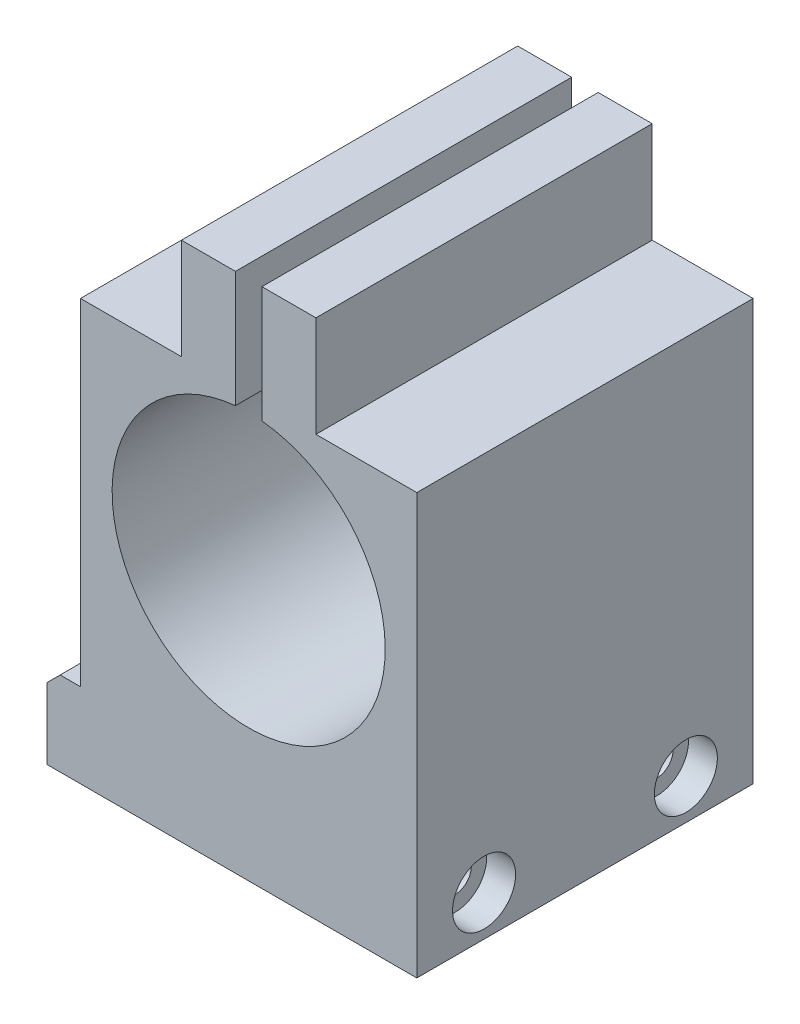
ISO-10303-21;
HEADER;
FILE_DESCRIPTION(('STEP AP214'),'2;1');
FILE_NAME('part.step','',(''),(''),'','','');
FILE_SCHEMA(('AUTOMOTIVE_DESIGN { 1 0 10303 214 1 1 1 1 }'));
ENDSEC;
DATA;
#1=APPLICATION_CONTEXT('core data for automotive mechanical design processes');
#2=APPLICATION_PROTOCOL_DEFINITION('international standard','automotive_design',2000,#1);
#3=PRODUCT_CONTEXT('',#1,'mechanical');
#4=PRODUCT('Part','Part','',(#3));
#5=PRODUCT_RELATED_PRODUCT_CATEGORY('part','',(#4));
#6=PRODUCT_DEFINITION_FORMATION('','',#4);
#7=PRODUCT_DEFINITION_CONTEXT('part definition',#1,'design');
#8=PRODUCT_DEFINITION('design','',#6,#7);
#9=PRODUCT_DEFINITION_SHAPE('','',#8);
#10=(LENGTH_UNIT() NAMED_UNIT(*) SI_UNIT(.MILLI.,.METRE.));
#11=(NAMED_UNIT(*) PLANE_ANGLE_UNIT() SI_UNIT($,.RADIAN.));
#12=(NAMED_UNIT(*) SI_UNIT($,.STERADIAN.) SOLID_ANGLE_UNIT());
#13=UNCERTAINTY_MEASURE_WITH_UNIT(LENGTH_MEASURE(1.E-05),#10,'distance_accuracy_value','');
#14=(GEOMETRIC_REPRESENTATION_CONTEXT(3) GLOBAL_UNCERTAINTY_ASSIGNED_CONTEXT((#13)) GLOBAL_UNIT_ASSIGNED_CONTEXT((#10,
#11,#12)) REPRESENTATION_CONTEXT('',''));
#15=CARTESIAN_POINT('',(0.,0.,0.));
#16=DIRECTION('',(0.,0.,1.));
#17=DIRECTION('',(1.,0.,0.));
#18=AXIS2_PLACEMENT_3D('',#15,#16,#17);
#19=CARTESIAN_POINT('',(15.3498255547082,26.67,25.4));
#20=DIRECTION('',(0.,0.,-1.));
#21=DIRECTION('',(-1.,0.,0.));
#22=AXIS2_PLACEMENT_3D('',#19,#20,#21);
#23=CYLINDRICAL_SURFACE('',#22,10.3124);
#24=CARTESIAN_POINT('',(15.3498255547082,26.67,0.));
#25=DIRECTION('',(0.,0.,1.));
#26=DIRECTION('',(1.,0.,0.));
#27=AXIS2_PLACEMENT_3D('',#24,#25,#26);
#28=CIRCLE('',#27,10.3124);
#29=CARTESIAN_POINT('',(14.3498255547082,36.9338001617335,0.));
#30=VERTEX_POINT('',#29);
#31=CARTESIAN_POINT('',(16.3498255547082,36.9338001617335,0.));
#32=VERTEX_POINT('',#31);
#33=EDGE_CURVE('E145',#30,#32,#28,.T.);
#34=ORIENTED_EDGE('',*,*,#33,.F.);
#35=DIRECTION('',(0.,0.,-1.));
#36=VECTOR('',#35,1.);
#37=CARTESIAN_POINT('',(14.3498255547082,36.9338001617335,25.4));
#38=LINE('',#37,#36);
#39=CARTESIAN_POINT('',(14.3498255547082,36.9338001617335,25.4));
#40=VERTEX_POINT('',#39);
#41=EDGE_CURVE('E140',#40,#30,#38,.T.);
#42=ORIENTED_EDGE('',*,*,#41,.F.);
#43=CARTESIAN_POINT('',(15.3498255547082,26.67,25.4));
#44=DIRECTION('',(0.,0.,1.));
#45=DIRECTION('',(1.,0.,0.));
#46=AXIS2_PLACEMENT_3D('',#43,#44,#45);
#47=CIRCLE('',#46,10.3124);
#48=CARTESIAN_POINT('',(16.3498255547082,36.9338001617335,25.4));
#49=VERTEX_POINT('',#48);
#50=EDGE_CURVE('E142',#40,#49,#47,.T.);
#51=ORIENTED_EDGE('',*,*,#50,.T.);
#52=DIRECTION('',(0.,0.,-1.));
#53=VECTOR('',#52,1.);
#54=CARTESIAN_POINT('',(16.3498255547082,36.9338001617335,25.4));
#55=LINE('',#54,#53);
#56=EDGE_CURVE('E194',#49,#32,#55,.T.);
#57=ORIENTED_EDGE('',*,*,#56,.T.);
#58=EDGE_LOOP('',(#34,#42,#51,#57));
#59=FACE_BOUND('',#58,.T.);
#60=ADVANCED_FACE('F35',(#59),#23,.F.);
#61=CARTESIAN_POINT('',(14.3498255547082,0.,25.4));
#62=DIRECTION('',(1.,0.,0.));
#63=DIRECTION('',(0.,0.,-1.));
#64=AXIS2_PLACEMENT_3D('',#61,#62,#63);
#65=PLANE('',#64);
#66=DIRECTION('',(0.,-1.,0.));
#67=VECTOR('',#66,1.);
#68=CARTESIAN_POINT('',(14.3498255547082,0.,0.));
#69=LINE('',#68,#67);
#70=CARTESIAN_POINT('',(14.3498255547082,45.72,0.));
#71=VERTEX_POINT('',#70);
#72=EDGE_CURVE('E196',#71,#30,#69,.T.);
#73=ORIENTED_EDGE('',*,*,#72,.F.);
#74=DIRECTION('',(0.,0.,-1.));
#75=VECTOR('',#74,1.);
#76=CARTESIAN_POINT('',(14.3498255547082,45.72,25.4));
#77=LINE('',#76,#75);
#78=CARTESIAN_POINT('',(14.3498255547082,45.72,25.4));
#79=VERTEX_POINT('',#78);
#80=EDGE_CURVE('E151',#79,#71,#77,.T.);
#81=ORIENTED_EDGE('',*,*,#80,.F.);
#82=DIRECTION('',(0.,-1.,0.));
#83=VECTOR('',#82,1.);
#84=CARTESIAN_POINT('',(14.3498255547082,0.,25.4));
#85=LINE('',#84,#83);
#86=EDGE_CURVE('E156',#79,#40,#85,.T.);
#87=ORIENTED_EDGE('',*,*,#86,.T.);
#88=ORIENTED_EDGE('',*,*,#41,.T.);
#89=EDGE_LOOP('',(#73,#81,#87,#88));
#90=FACE_BOUND('',#89,.T.);
#91=ADVANCED_FACE('F161',(#90),#65,.T.);
#92=CARTESIAN_POINT('',(0.,45.72,25.4));
#93=DIRECTION('',(0.,-1.,0.));
#94=DIRECTION('',(0.,0.,-1.));
#95=AXIS2_PLACEMENT_3D('',#92,#93,#94);
#96=PLANE('',#95);
#97=DIRECTION('',(-1.,0.,0.));
#98=VECTOR('',#97,1.);
#99=CARTESIAN_POINT('',(0.,45.72,0.));
#100=LINE('',#99,#98);
#101=CARTESIAN_POINT('',(10.2698255547082,45.72,0.));
#102=VERTEX_POINT('',#101);
#103=EDGE_CURVE('E199',#71,#102,#100,.T.);
#104=ORIENTED_EDGE('',*,*,#103,.T.);
#105=DIRECTION('',(0.,0.,-1.));
#106=VECTOR('',#105,1.);
#107=CARTESIAN_POINT('',(10.2698255547082,45.72,25.4));
#108=LINE('',#107,#106);
#109=CARTESIAN_POINT('',(10.2698255547082,45.72,25.4));
#110=VERTEX_POINT('',#109);
#111=EDGE_CURVE('E252',#110,#102,#108,.T.);
#112=ORIENTED_EDGE('',*,*,#111,.F.);
#113=DIRECTION('',(-1.,0.,0.));
#114=VECTOR('',#113,1.);
#115=CARTESIAN_POINT('',(0.,45.72,25.4));
#116=LINE('',#115,#114);
#117=EDGE_CURVE('E163',#79,#110,#116,.T.);
#118=ORIENTED_EDGE('',*,*,#117,.F.);
#119=ORIENTED_EDGE('',*,*,#80,.T.);
#120=EDGE_LOOP('',(#104,#112,#118,#119));
#121=FACE_BOUND('',#120,.T.);
#122=ADVANCED_FACE('F291',(#121),#96,.F.);
#123=CARTESIAN_POINT('',(10.2698255547082,0.,25.4));
#124=DIRECTION('',(-1.,0.,0.));
#125=DIRECTION('',(0.,0.,1.));
#126=AXIS2_PLACEMENT_3D('',#123,#124,#125);
#127=PLANE('',#126);
#128=DIRECTION('',(0.,1.,0.));
#129=VECTOR('',#128,1.);
#130=CARTESIAN_POINT('',(10.2698255547082,0.,0.));
#131=LINE('',#130,#129);
#132=CARTESIAN_POINT('',(10.2698255547082,38.1,0.));
#133=VERTEX_POINT('',#132);
#134=EDGE_CURVE('E202',#133,#102,#131,.T.);
#135=ORIENTED_EDGE('',*,*,#134,.F.);
#136=DIRECTION('',(0.,0.,-1.));
#137=VECTOR('',#136,1.);
#138=CARTESIAN_POINT('',(10.2698255547082,38.1,25.4));
#139=LINE('',#138,#137);
#140=CARTESIAN_POINT('',(10.2698255547082,38.1,25.4));
#141=VERTEX_POINT('',#140);
#142=EDGE_CURVE('E250',#141,#133,#139,.T.);
#143=ORIENTED_EDGE('',*,*,#142,.F.);
#144=DIRECTION('',(0.,1.,0.));
#145=VECTOR('',#144,1.);
#146=CARTESIAN_POINT('',(10.2698255547082,0.,25.4));
#147=LINE('',#146,#145);
#148=EDGE_CURVE('E165',#141,#110,#147,.T.);
#149=ORIENTED_EDGE('',*,*,#148,.T.);
#150=ORIENTED_EDGE('',*,*,#111,.T.);
#151=EDGE_LOOP('',(#135,#143,#149,#150));
#152=FACE_BOUND('',#151,.T.);
#153=ADVANCED_FACE('F296',(#152),#127,.T.);
#154=CARTESIAN_POINT('',(0.,38.1,25.4));
#155=DIRECTION('',(0.,1.,0.));
#156=DIRECTION('',(0.,0.,1.));
#157=AXIS2_PLACEMENT_3D('',#154,#155,#156);
#158=PLANE('',#157);
#159=DIRECTION('',(1.,0.,0.));
#160=VECTOR('',#159,1.);
#161=CARTESIAN_POINT('',(0.,38.1,0.));
#162=LINE('',#161,#160);
#163=CARTESIAN_POINT('',(2.64982555470824,38.1,0.));
#164=VERTEX_POINT('',#163);
#165=EDGE_CURVE('E205',#164,#133,#162,.T.);
#166=ORIENTED_EDGE('',*,*,#165,.F.);
#167=DIRECTION('',(0.,0.,-1.));
#168=VECTOR('',#167,1.);
#169=CARTESIAN_POINT('',(2.64982555470824,38.1,25.4));
#170=LINE('',#169,#168);
#171=CARTESIAN_POINT('',(2.64982555470824,38.1,25.4));
#172=VERTEX_POINT('',#171);
#173=EDGE_CURVE('E248',#172,#164,#170,.T.);
#174=ORIENTED_EDGE('',*,*,#173,.F.);
#175=DIRECTION('',(1.,0.,0.));
#176=VECTOR('',#175,1.);
#177=CARTESIAN_POINT('',(0.,38.1,25.4));
#178=LINE('',#177,#176);
#179=EDGE_CURVE('E171',#172,#141,#178,.T.);
#180=ORIENTED_EDGE('',*,*,#179,.T.);
#181=ORIENTED_EDGE('',*,*,#142,.T.);
#182=EDGE_LOOP('',(#166,#174,#180,#181));
#183=FACE_BOUND('',#182,.T.);
#184=ADVANCED_FACE('F300',(#183),#158,.T.);
#185=CARTESIAN_POINT('',(2.64982555470824,0.,25.4));
#186=DIRECTION('',(-1.,0.,0.));
#187=DIRECTION('',(0.,0.,1.));
#188=AXIS2_PLACEMENT_3D('',#185,#186,#187);
#189=PLANE('',#188);
#190=DIRECTION('',(0.,1.,0.));
#191=VECTOR('',#190,1.);
#192=CARTESIAN_POINT('',(2.64982555470824,0.,0.));
#193=LINE('',#192,#191);
#194=CARTESIAN_POINT('',(2.64982555470824,12.7,0.));
#195=VERTEX_POINT('',#194);
#196=EDGE_CURVE('E208',#195,#164,#193,.T.);
#197=ORIENTED_EDGE('',*,*,#196,.F.);
#198=DIRECTION('',(0.,0.,-1.));
#199=VECTOR('',#198,1.);
#200=CARTESIAN_POINT('',(2.64982555470824,12.7,25.4));
#201=LINE('',#200,#199);
#202=CARTESIAN_POINT('',(2.64982555470824,12.7,25.4));
#203=VERTEX_POINT('',#202);
#204=EDGE_CURVE('E245',#203,#195,#201,.T.);
#205=ORIENTED_EDGE('',*,*,#204,.F.);
#206=DIRECTION('',(0.,1.,0.));
#207=VECTOR('',#206,1.);
#208=CARTESIAN_POINT('',(2.64982555470824,0.,25.4));
#209=LINE('',#208,#207);
#210=EDGE_CURVE('E174',#203,#172,#209,.T.);
#211=ORIENTED_EDGE('',*,*,#210,.T.);
#212=ORIENTED_EDGE('',*,*,#173,.T.);
#213=EDGE_LOOP('',(#197,#205,#211,#212));
#214=FACE_BOUND('',#213,.T.);
#215=ADVANCED_FACE('F304',(#214),#189,.T.);
#216=CARTESIAN_POINT('',(0.,12.7,25.4));
#217=DIRECTION('',(0.,1.,0.));
#218=DIRECTION('',(0.,0.,1.));
#219=AXIS2_PLACEMENT_3D('',#216,#217,#218);
#220=PLANE('',#219);
#221=DIRECTION('',(1.,0.,0.));
#222=VECTOR('',#221,1.);
#223=CARTESIAN_POINT('',(0.,12.7,0.));
#224=LINE('',#223,#222);
#225=CARTESIAN_POINT('',(1.10982555470824,12.7,0.));
#226=VERTEX_POINT('',#225);
#227=EDGE_CURVE('E211',#226,#195,#224,.T.);
#228=ORIENTED_EDGE('',*,*,#227,.F.);
#229=DIRECTION('',(0.,0.,1.));
#230=VECTOR('',#229,1.);
#231=CARTESIAN_POINT('',(1.10982555470824,12.7,25.4));
#232=LINE('',#231,#230);
#233=CARTESIAN_POINT('',(1.10982555470824,12.7,25.4));
#234=VERTEX_POINT('',#233);
#235=EDGE_CURVE('E43',#226,#234,#232,.T.);
#236=ORIENTED_EDGE('',*,*,#235,.T.);
#237=DIRECTION('',(1.,0.,0.));
#238=VECTOR('',#237,1.);
#239=CARTESIAN_POINT('',(0.,12.7,25.4));
#240=LINE('',#239,#238);
#241=EDGE_CURVE('E177',#234,#203,#240,.T.);
#242=ORIENTED_EDGE('',*,*,#241,.T.);
#243=ORIENTED_EDGE('',*,*,#204,.T.);
#244=EDGE_LOOP('',(#228,#236,#242,#243));
#245=FACE_BOUND('',#244,.T.);
#246=ADVANCED_FACE('F308',(#245),#220,.T.);
#247=CARTESIAN_POINT('',(0.109825554708236,0.,25.4));
#248=DIRECTION('',(-1.,0.,0.));
#249=DIRECTION('',(0.,0.,1.));
#250=AXIS2_PLACEMENT_3D('',#247,#248,#249);
#251=PLANE('',#250);
#252=CARTESIAN_POINT('',(0.109825554708235,9.39799999999999,20.32));
#253=DIRECTION('',(1.,0.,0.));
#254=DIRECTION('',(0.,0.,-1.));
#255=AXIS2_PLACEMENT_3D('',#252,#253,#254);
#256=CIRCLE('',#255,1.21919999999999);
#257=CARTESIAN_POINT('',(0.109825554708235,9.39799999999999,19.1008));
#258=VERTEX_POINT('',#257);
#259=EDGE_CURVE('E371',#258,#258,#256,.T.);
#260=ORIENTED_EDGE('',*,*,#259,.T.);
#261=EDGE_LOOP('',(#260));
#262=FACE_BOUND('',#261,.T.);
#263=CARTESIAN_POINT('',(0.109825554708235,9.39799999999999,5.08));
#264=DIRECTION('',(1.,0.,0.));
#265=DIRECTION('',(0.,0.,-1.));
#266=AXIS2_PLACEMENT_3D('',#263,#264,#265);
#267=CIRCLE('',#266,1.21919999999999);
#268=CARTESIAN_POINT('',(0.109825554708235,9.39799999999999,3.86080000000001));
#269=VERTEX_POINT('',#268);
#270=EDGE_CURVE('E197',#269,#269,#267,.T.);
#271=ORIENTED_EDGE('',*,*,#270,.T.);
#272=EDGE_LOOP('',(#271));
#273=FACE_BOUND('',#272,.T.);
#274=DIRECTION('',(0.,1.,0.));
#275=VECTOR('',#274,1.);
#276=CARTESIAN_POINT('',(0.109825554708236,0.,25.4));
#277=LINE('',#276,#275);
#278=CARTESIAN_POINT('',(0.109825554708236,6.35,25.4));
#279=VERTEX_POINT('',#278);
#280=CARTESIAN_POINT('',(0.109825554708236,11.7,25.4));
#281=VERTEX_POINT('',#280);
#282=EDGE_CURVE('E179',#279,#281,#277,.T.);
#283=ORIENTED_EDGE('',*,*,#282,.T.);
#284=DIRECTION('',(0.,0.,-1.));
#285=VECTOR('',#284,1.);
#286=CARTESIAN_POINT('',(0.109825554708236,11.7,25.4));
#287=LINE('',#286,#285);
#288=CARTESIAN_POINT('',(0.109825554708236,11.7,0.));
#289=VERTEX_POINT('',#288);
#290=EDGE_CURVE('E150',#281,#289,#287,.T.);
#291=ORIENTED_EDGE('',*,*,#290,.T.);
#292=DIRECTION('',(0.,1.,0.));
#293=VECTOR('',#292,1.);
#294=CARTESIAN_POINT('',(0.109825554708236,0.,0.));
#295=LINE('',#294,#293);
#296=CARTESIAN_POINT('',(0.109825554708236,6.35,0.));
#297=VERTEX_POINT('',#296);
#298=EDGE_CURVE('E213',#297,#289,#295,.T.);
#299=ORIENTED_EDGE('',*,*,#298,.F.);
#300=DIRECTION('',(0.,0.,-1.));
#301=VECTOR('',#300,1.);
#302=CARTESIAN_POINT('',(0.109825554708236,6.35,25.4));
#303=LINE('',#302,#301);
#304=EDGE_CURVE('E243',#279,#297,#303,.T.);
#305=ORIENTED_EDGE('',*,*,#304,.F.);
#306=EDGE_LOOP('',(#283,#291,#299,#305));
#307=FACE_BOUND('',#306,.T.);
#308=ADVANCED_FACE('F260',(#262,#273,#307),#251,.T.);
#309=CARTESIAN_POINT('',(0.,6.35,25.4));
#310=DIRECTION('',(0.,1.,0.));
#311=DIRECTION('',(0.,0.,1.));
#312=AXIS2_PLACEMENT_3D('',#309,#310,#311);
#313=PLANE('',#312);
#314=DIRECTION('',(1.,0.,0.));
#315=VECTOR('',#314,1.);
#316=CARTESIAN_POINT('',(0.,6.35,0.));
#317=LINE('',#316,#315);
#318=CARTESIAN_POINT('',(28.0498255547082,6.35,0.));
#319=VERTEX_POINT('',#318);
#320=EDGE_CURVE('E215',#297,#319,#317,.T.);
#321=ORIENTED_EDGE('',*,*,#320,.T.);
#322=DIRECTION('',(0.,0.,-1.));
#323=VECTOR('',#322,1.);
#324=CARTESIAN_POINT('',(28.0498255547082,6.35,25.4));
#325=LINE('',#324,#323);
#326=CARTESIAN_POINT('',(28.0498255547082,6.35,25.4));
#327=VERTEX_POINT('',#326);
#328=EDGE_CURVE('E240',#327,#319,#325,.T.);
#329=ORIENTED_EDGE('',*,*,#328,.F.);
#330=DIRECTION('',(1.,0.,0.));
#331=VECTOR('',#330,1.);
#332=CARTESIAN_POINT('',(0.,6.35,25.4));
#333=LINE('',#332,#331);
#334=EDGE_CURVE('E182',#279,#327,#333,.T.);
#335=ORIENTED_EDGE('',*,*,#334,.F.);
#336=ORIENTED_EDGE('',*,*,#304,.T.);
#337=EDGE_LOOP('',(#321,#329,#335,#336));
#338=FACE_BOUND('',#337,.T.);
#339=ADVANCED_FACE('F269',(#338),#313,.F.);
#340=CARTESIAN_POINT('',(28.0498255547082,0.,25.4));
#341=DIRECTION('',(-1.,0.,0.));
#342=DIRECTION('',(0.,0.,1.));
#343=AXIS2_PLACEMENT_3D('',#340,#341,#342);
#344=PLANE('',#343);
#345=CARTESIAN_POINT('',(28.0498255547082,9.39799999999999,20.32));
#346=DIRECTION('',(1.,0.,0.));
#347=DIRECTION('',(0.,0.,-1.));
#348=AXIS2_PLACEMENT_3D('',#345,#346,#347);
#349=CIRCLE('',#348,2.38124999999999);
#350=CARTESIAN_POINT('',(28.0498255547082,9.39799999999999,17.93875));
#351=VERTEX_POINT('',#350);
#352=EDGE_CURVE('E364',#351,#351,#349,.T.);
#353=ORIENTED_EDGE('',*,*,#352,.F.);
#354=EDGE_LOOP('',(#353));
#355=FACE_BOUND('',#354,.T.);
#356=CARTESIAN_POINT('',(28.0498255547082,9.39799999999999,5.08));
#357=DIRECTION('',(1.,0.,0.));
#358=DIRECTION('',(0.,0.,-1.));
#359=AXIS2_PLACEMENT_3D('',#356,#357,#358);
#360=CIRCLE('',#359,2.38124999999999);
#361=CARTESIAN_POINT('',(28.0498255547082,9.39799999999999,2.69875000000001));
#362=VERTEX_POINT('',#361);
#363=EDGE_CURVE('E374',#362,#362,#360,.T.);
#364=ORIENTED_EDGE('',*,*,#363,.F.);
#365=EDGE_LOOP('',(#364));
#366=FACE_BOUND('',#365,.T.);
#367=DIRECTION('',(0.,1.,0.));
#368=VECTOR('',#367,1.);
#369=CARTESIAN_POINT('',(28.0498255547082,0.,0.));
#370=LINE('',#369,#368);
#371=CARTESIAN_POINT('',(28.0498255547082,38.1,0.));
#372=VERTEX_POINT('',#371);
#373=EDGE_CURVE('E217',#319,#372,#370,.T.);
#374=ORIENTED_EDGE('',*,*,#373,.T.);
#375=DIRECTION('',(0.,0.,-1.));
#376=VECTOR('',#375,1.);
#377=CARTESIAN_POINT('',(28.0498255547082,38.1,25.4));
#378=LINE('',#377,#376);
#379=CARTESIAN_POINT('',(28.0498255547082,38.1,25.4));
#380=VERTEX_POINT('',#379);
#381=EDGE_CURVE('E238',#380,#372,#378,.T.);
#382=ORIENTED_EDGE('',*,*,#381,.F.);
#383=DIRECTION('',(0.,1.,0.));
#384=VECTOR('',#383,1.);
#385=CARTESIAN_POINT('',(28.0498255547082,0.,25.4));
#386=LINE('',#385,#384);
#387=EDGE_CURVE('E184',#327,#380,#386,.T.);
#388=ORIENTED_EDGE('',*,*,#387,.F.);
#389=ORIENTED_EDGE('',*,*,#328,.T.);
#390=EDGE_LOOP('',(#374,#382,#388,#389));
#391=FACE_BOUND('',#390,.T.);
#392=ADVANCED_FACE('F273',(#355,#366,#391),#344,.F.);
#393=CARTESIAN_POINT('',(0.,38.1,25.4));
#394=DIRECTION('',(0.,1.,0.));
#395=DIRECTION('',(0.,0.,1.));
#396=AXIS2_PLACEMENT_3D('',#393,#394,#395);
#397=PLANE('',#396);
#398=DIRECTION('',(1.,0.,0.));
#399=VECTOR('',#398,1.);
#400=CARTESIAN_POINT('',(0.,38.1,0.));
#401=LINE('',#400,#399);
#402=CARTESIAN_POINT('',(20.4298255547082,38.1,0.));
#403=VERTEX_POINT('',#402);
#404=EDGE_CURVE('E220',#403,#372,#401,.T.);
#405=ORIENTED_EDGE('',*,*,#404,.F.);
#406=DIRECTION('',(0.,0.,-1.));
#407=VECTOR('',#406,1.);
#408=CARTESIAN_POINT('',(20.4298255547082,38.1,25.4));
#409=LINE('',#408,#407);
#410=CARTESIAN_POINT('',(20.4298255547082,38.1,25.4));
#411=VERTEX_POINT('',#410);
#412=EDGE_CURVE('E236',#411,#403,#409,.T.);
#413=ORIENTED_EDGE('',*,*,#412,.F.);
#414=DIRECTION('',(1.,0.,0.));
#415=VECTOR('',#414,1.);
#416=CARTESIAN_POINT('',(0.,38.1,25.4));
#417=LINE('',#416,#415);
#418=EDGE_CURVE('E186',#411,#380,#417,.T.);
#419=ORIENTED_EDGE('',*,*,#418,.T.);
#420=ORIENTED_EDGE('',*,*,#381,.T.);
#421=EDGE_LOOP('',(#405,#413,#419,#420));
#422=FACE_BOUND('',#421,.T.);
#423=ADVANCED_FACE('F319',(#422),#397,.T.);
#424=CARTESIAN_POINT('',(20.4298255547082,0.,25.4));
#425=DIRECTION('',(-1.,0.,0.));
#426=DIRECTION('',(0.,0.,1.));
#427=AXIS2_PLACEMENT_3D('',#424,#425,#426);
#428=PLANE('',#427);
#429=DIRECTION('',(0.,1.,0.));
#430=VECTOR('',#429,1.);
#431=CARTESIAN_POINT('',(20.4298255547082,0.,0.));
#432=LINE('',#431,#430);
#433=CARTESIAN_POINT('',(20.4298255547082,45.72,0.));
#434=VERTEX_POINT('',#433);
#435=EDGE_CURVE('E223',#403,#434,#432,.T.);
#436=ORIENTED_EDGE('',*,*,#435,.T.);
#437=DIRECTION('',(0.,0.,-1.));
#438=VECTOR('',#437,1.);
#439=CARTESIAN_POINT('',(20.4298255547082,45.72,25.4));
#440=LINE('',#439,#438);
#441=CARTESIAN_POINT('',(20.4298255547082,45.72,25.4));
#442=VERTEX_POINT('',#441);
#443=EDGE_CURVE('E233',#442,#434,#440,.T.);
#444=ORIENTED_EDGE('',*,*,#443,.F.);
#445=DIRECTION('',(0.,1.,0.));
#446=VECTOR('',#445,1.);
#447=CARTESIAN_POINT('',(20.4298255547082,0.,25.4));
#448=LINE('',#447,#446);
#449=EDGE_CURVE('E189',#411,#442,#448,.T.);
#450=ORIENTED_EDGE('',*,*,#449,.F.);
#451=ORIENTED_EDGE('',*,*,#412,.T.);
#452=EDGE_LOOP('',(#436,#444,#450,#451));
#453=FACE_BOUND('',#452,.T.);
#454=ADVANCED_FACE('F323',(#453),#428,.F.);
#455=CARTESIAN_POINT('',(0.,45.72,25.4));
#456=DIRECTION('',(0.,-1.,0.));
#457=DIRECTION('',(1.,0.,0.));
#458=AXIS2_PLACEMENT_3D('',#455,#456,#457);
#459=PLANE('',#458);
#460=DIRECTION('',(-1.,0.,0.));
#461=VECTOR('',#460,1.);
#462=CARTESIAN_POINT('',(0.,45.72,0.));
#463=LINE('',#462,#461);
#464=CARTESIAN_POINT('',(16.3498255547082,45.72,0.));
#465=VERTEX_POINT('',#464);
#466=EDGE_CURVE('E225',#434,#465,#463,.T.);
#467=ORIENTED_EDGE('',*,*,#466,.T.);
#468=DIRECTION('',(0.,0.,-1.));
#469=VECTOR('',#468,1.);
#470=CARTESIAN_POINT('',(16.3498255547082,45.72,25.4));
#471=LINE('',#470,#469);
#472=CARTESIAN_POINT('',(16.3498255547082,45.72,25.4));
#473=VERTEX_POINT('',#472);
#474=EDGE_CURVE('E231',#473,#465,#471,.T.);
#475=ORIENTED_EDGE('',*,*,#474,.F.);
#476=DIRECTION('',(-1.,0.,0.));
#477=VECTOR('',#476,1.);
#478=CARTESIAN_POINT('',(0.,45.72,25.4));
#479=LINE('',#478,#477);
#480=EDGE_CURVE('E191',#442,#473,#479,.T.);
#481=ORIENTED_EDGE('',*,*,#480,.F.);
#482=ORIENTED_EDGE('',*,*,#443,.T.);
#483=EDGE_LOOP('',(#467,#475,#481,#482));
#484=FACE_BOUND('',#483,.T.);
#485=ADVANCED_FACE('F327',(#484),#459,.F.);
#486=CARTESIAN_POINT('',(16.3498255547082,0.,25.4));
#487=DIRECTION('',(-1.,0.,0.));
#488=DIRECTION('',(0.,0.,1.));
#489=AXIS2_PLACEMENT_3D('',#486,#487,#488);
#490=PLANE('',#489);
#491=DIRECTION('',(0.,1.,0.));
#492=VECTOR('',#491,1.);
#493=CARTESIAN_POINT('',(16.3498255547082,0.,0.));
#494=LINE('',#493,#492);
#495=EDGE_CURVE('E159',#32,#465,#494,.T.);
#496=ORIENTED_EDGE('',*,*,#495,.F.);
#497=ORIENTED_EDGE('',*,*,#56,.F.);
#498=DIRECTION('',(0.,1.,0.));
#499=VECTOR('',#498,1.);
#500=CARTESIAN_POINT('',(16.3498255547082,0.,25.4));
#501=LINE('',#500,#499);
#502=EDGE_CURVE('E158',#49,#473,#501,.T.);
#503=ORIENTED_EDGE('',*,*,#502,.T.);
#504=ORIENTED_EDGE('',*,*,#474,.T.);
#505=EDGE_LOOP('',(#496,#497,#503,#504));
#506=FACE_BOUND('',#505,.T.);
#507=ADVANCED_FACE('F331',(#506),#490,.T.);
#508=CARTESIAN_POINT('',(0.,0.,25.4));
#509=DIRECTION('',(0.,0.,1.));
#510=DIRECTION('',(1.,0.,0.));
#511=AXIS2_PLACEMENT_3D('',#508,#509,#510);
#512=PLANE('',#511);
#513=ORIENTED_EDGE('',*,*,#241,.F.);
#514=DIRECTION('',(0.70710678118655,0.707106781186545,0.));
#515=VECTOR('',#514,1.);
#516=CARTESIAN_POINT('',(-5.79508722264589,5.79508722264593,25.4));
#517=LINE('',#516,#515);
#518=EDGE_CURVE('E11',#234,#281,#517,.F.);
#519=ORIENTED_EDGE('',*,*,#518,.T.);
#520=ORIENTED_EDGE('',*,*,#282,.F.);
#521=ORIENTED_EDGE('',*,*,#334,.T.);
#522=ORIENTED_EDGE('',*,*,#387,.T.);
#523=ORIENTED_EDGE('',*,*,#418,.F.);
#524=ORIENTED_EDGE('',*,*,#449,.T.);
#525=ORIENTED_EDGE('',*,*,#480,.T.);
#526=ORIENTED_EDGE('',*,*,#502,.F.);
#527=ORIENTED_EDGE('',*,*,#50,.F.);
#528=ORIENTED_EDGE('',*,*,#86,.F.);
#529=ORIENTED_EDGE('',*,*,#117,.T.);
#530=ORIENTED_EDGE('',*,*,#148,.F.);
#531=ORIENTED_EDGE('',*,*,#179,.F.);
#532=ORIENTED_EDGE('',*,*,#210,.F.);
#533=EDGE_LOOP('',(#513,#519,#520,#521,#522,#523,#524,#525,#526,#527,#528,#529,#530,#531,#532));
#534=FACE_BOUND('',#533,.T.);
#535=ADVANCED_FACE('F155',(#534),#512,.T.);
#536=CARTESIAN_POINT('',(0.,0.,0.));
#537=DIRECTION('',(0.,0.,1.));
#538=DIRECTION('',(1.,0.,0.));
#539=AXIS2_PLACEMENT_3D('',#536,#537,#538);
#540=PLANE('',#539);
#541=ORIENTED_EDGE('',*,*,#298,.T.);
#542=DIRECTION('',(-0.70710678118655,-0.707106781186545,0.));
#543=VECTOR('',#542,1.);
#544=CARTESIAN_POINT('',(0.109825554708236,11.7,0.));
#545=LINE('',#544,#543);
#546=EDGE_CURVE('E57',#289,#226,#545,.F.);
#547=ORIENTED_EDGE('',*,*,#546,.T.);
#548=ORIENTED_EDGE('',*,*,#227,.T.);
#549=ORIENTED_EDGE('',*,*,#196,.T.);
#550=ORIENTED_EDGE('',*,*,#165,.T.);
#551=ORIENTED_EDGE('',*,*,#134,.T.);
#552=ORIENTED_EDGE('',*,*,#103,.F.);
#553=ORIENTED_EDGE('',*,*,#72,.T.);
#554=ORIENTED_EDGE('',*,*,#33,.T.);
#555=ORIENTED_EDGE('',*,*,#495,.T.);
#556=ORIENTED_EDGE('',*,*,#466,.F.);
#557=ORIENTED_EDGE('',*,*,#435,.F.);
#558=ORIENTED_EDGE('',*,*,#404,.T.);
#559=ORIENTED_EDGE('',*,*,#373,.F.);
#560=ORIENTED_EDGE('',*,*,#320,.F.);
#561=EDGE_LOOP('',(#541,#547,#548,#549,#550,#551,#552,#553,#554,#555,#556,#557,#558,#559,#560));
#562=FACE_BOUND('',#561,.T.);
#563=ADVANCED_FACE('F265',(#562),#540,.F.);
#564=CARTESIAN_POINT('',(0.109825554708236,11.7,25.4));
#565=DIRECTION('',(0.707106781186545,-0.70710678118655,0.));
#566=DIRECTION('',(0.,0.,-1.));
#567=AXIS2_PLACEMENT_3D('',#564,#565,#566);
#568=PLANE('',#567);
#569=ORIENTED_EDGE('',*,*,#518,.F.);
#570=ORIENTED_EDGE('',*,*,#235,.F.);
#571=ORIENTED_EDGE('',*,*,#546,.F.);
#572=ORIENTED_EDGE('',*,*,#290,.F.);
#573=EDGE_LOOP('',(#569,#570,#571,#572));
#574=FACE_BOUND('',#573,.T.);
#575=ADVANCED_FACE('F37',(#574),#568,.F.);
#576=CARTESIAN_POINT('',(28.0498255547082,9.39799999999999,5.08));
#577=DIRECTION('',(1.,0.,0.));
#578=DIRECTION('',(0.,0.,-1.));
#579=AXIS2_PLACEMENT_3D('',#576,#577,#578);
#580=CYLINDRICAL_SURFACE('',#579,1.2192);
#581=ORIENTED_EDGE('',*,*,#270,.F.);
#582=EDGE_LOOP('',(#581));
#583=FACE_BOUND('',#582,.T.);
#584=CARTESIAN_POINT('',(25.8654255547082,9.39799999999999,5.08));
#585=DIRECTION('',(1.,0.,0.));
#586=DIRECTION('',(0.,0.,-1.));
#587=AXIS2_PLACEMENT_3D('',#584,#585,#586);
#588=CIRCLE('',#587,1.2192);
#589=CARTESIAN_POINT('',(25.8654255547082,9.39799999999999,3.8608));
#590=VERTEX_POINT('',#589);
#591=EDGE_CURVE('E380',#590,#590,#588,.T.);
#592=ORIENTED_EDGE('',*,*,#591,.T.);
#593=EDGE_LOOP('',(#592));
#594=FACE_BOUND('',#593,.T.);
#595=ADVANCED_FACE('F278',(#583,#594),#580,.F.);
#596=CARTESIAN_POINT('',(25.8654255547082,10.6172,5.08));
#597=DIRECTION('',(-1.,0.,0.));
#598=DIRECTION('',(0.,0.,1.));
#599=AXIS2_PLACEMENT_3D('',#596,#597,#598);
#600=PLANE('',#599);
#601=ORIENTED_EDGE('',*,*,#591,.F.);
#602=EDGE_LOOP('',(#601));
#603=FACE_BOUND('',#602,.T.);
#604=CARTESIAN_POINT('',(25.8654255547082,9.39799999999999,5.08));
#605=DIRECTION('',(1.,0.,0.));
#606=DIRECTION('',(0.,0.,-1.));
#607=AXIS2_PLACEMENT_3D('',#604,#605,#606);
#608=CIRCLE('',#607,2.38125);
#609=CARTESIAN_POINT('',(25.8654255547082,9.39799999999999,2.69875));
#610=VERTEX_POINT('',#609);
#611=EDGE_CURVE('E377',#610,#610,#608,.T.);
#612=ORIENTED_EDGE('',*,*,#611,.T.);
#613=EDGE_LOOP('',(#612));
#614=FACE_BOUND('',#613,.T.);
#615=ADVANCED_FACE('F283',(#603,#614),#600,.F.);
#616=CARTESIAN_POINT('',(28.0498255547082,9.39799999999999,5.08));
#617=DIRECTION('',(1.,0.,0.));
#618=DIRECTION('',(0.,0.,-1.));
#619=AXIS2_PLACEMENT_3D('',#616,#617,#618);
#620=CYLINDRICAL_SURFACE('',#619,2.38125);
#621=ORIENTED_EDGE('',*,*,#611,.F.);
#622=EDGE_LOOP('',(#621));
#623=FACE_BOUND('',#622,.T.);
#624=ORIENTED_EDGE('',*,*,#363,.T.);
#625=EDGE_LOOP('',(#624));
#626=FACE_BOUND('',#625,.T.);
#627=ADVANCED_FACE('F340',(#623,#626),#620,.F.);
#628=CARTESIAN_POINT('',(28.0498255547082,9.39799999999999,20.32));
#629=DIRECTION('',(1.,0.,0.));
#630=DIRECTION('',(0.,0.,-1.));
#631=AXIS2_PLACEMENT_3D('',#628,#629,#630);
#632=CYLINDRICAL_SURFACE('',#631,1.2192);
#633=ORIENTED_EDGE('',*,*,#259,.F.);
#634=EDGE_LOOP('',(#633));
#635=FACE_BOUND('',#634,.T.);
#636=CARTESIAN_POINT('',(25.8654255547082,9.39799999999999,20.32));
#637=DIRECTION('',(1.,0.,0.));
#638=DIRECTION('',(0.,0.,-1.));
#639=AXIS2_PLACEMENT_3D('',#636,#637,#638);
#640=CIRCLE('',#639,1.2192);
#641=CARTESIAN_POINT('',(25.8654255547082,9.39799999999999,19.1008));
#642=VERTEX_POINT('',#641);
#643=EDGE_CURVE('E366',#642,#642,#640,.T.);
#644=ORIENTED_EDGE('',*,*,#643,.T.);
#645=EDGE_LOOP('',(#644));
#646=FACE_BOUND('',#645,.T.);
#647=ADVANCED_FACE('F344',(#635,#646),#632,.F.);
#648=CARTESIAN_POINT('',(25.8654255547082,10.6172,20.32));
#649=DIRECTION('',(-1.,0.,0.));
#650=DIRECTION('',(0.,0.,1.));
#651=AXIS2_PLACEMENT_3D('',#648,#649,#650);
#652=PLANE('',#651);
#653=ORIENTED_EDGE('',*,*,#643,.F.);
#654=EDGE_LOOP('',(#653));
#655=FACE_BOUND('',#654,.T.);
#656=CARTESIAN_POINT('',(25.8654255547082,9.39799999999999,20.32));
#657=DIRECTION('',(1.,0.,0.));
#658=DIRECTION('',(0.,0.,-1.));
#659=AXIS2_PLACEMENT_3D('',#656,#657,#658);
#660=CIRCLE('',#659,2.38125);
#661=CARTESIAN_POINT('',(25.8654255547082,9.39799999999999,17.93875));
#662=VERTEX_POINT('',#661);
#663=EDGE_CURVE('E361',#662,#662,#660,.T.);
#664=ORIENTED_EDGE('',*,*,#663,.T.);
#665=EDGE_LOOP('',(#664));
#666=FACE_BOUND('',#665,.T.);
#667=ADVANCED_FACE('F348',(#655,#666),#652,.F.);
#668=CARTESIAN_POINT('',(28.0498255547082,9.39799999999999,20.32));
#669=DIRECTION('',(1.,0.,0.));
#670=DIRECTION('',(0.,0.,-1.));
#671=AXIS2_PLACEMENT_3D('',#668,#669,#670);
#672=CYLINDRICAL_SURFACE('',#671,2.38125);
#673=ORIENTED_EDGE('',*,*,#663,.F.);
#674=EDGE_LOOP('',(#673));
#675=FACE_BOUND('',#674,.T.);
#676=ORIENTED_EDGE('',*,*,#352,.T.);
#677=EDGE_LOOP('',(#676));
#678=FACE_BOUND('',#677,.T.);
#679=ADVANCED_FACE('F352',(#675,#678),#672,.F.);
#680=CLOSED_SHELL('',(#60,#91,#122,#153,#184,#215,#246,#308,#339,#392,#423,#454,#485,#507,#535,
#563,#575,#595,#615,#627,#647,#667,#679));
#681=MANIFOLD_SOLID_BREP('B2',#680);
#682=ADVANCED_BREP_SHAPE_REPRESENTATION('',(#18,#681),#14);
#683=SHAPE_DEFINITION_REPRESENTATION(#9,#682);
ENDSEC;
END-ISO-10303-21;
